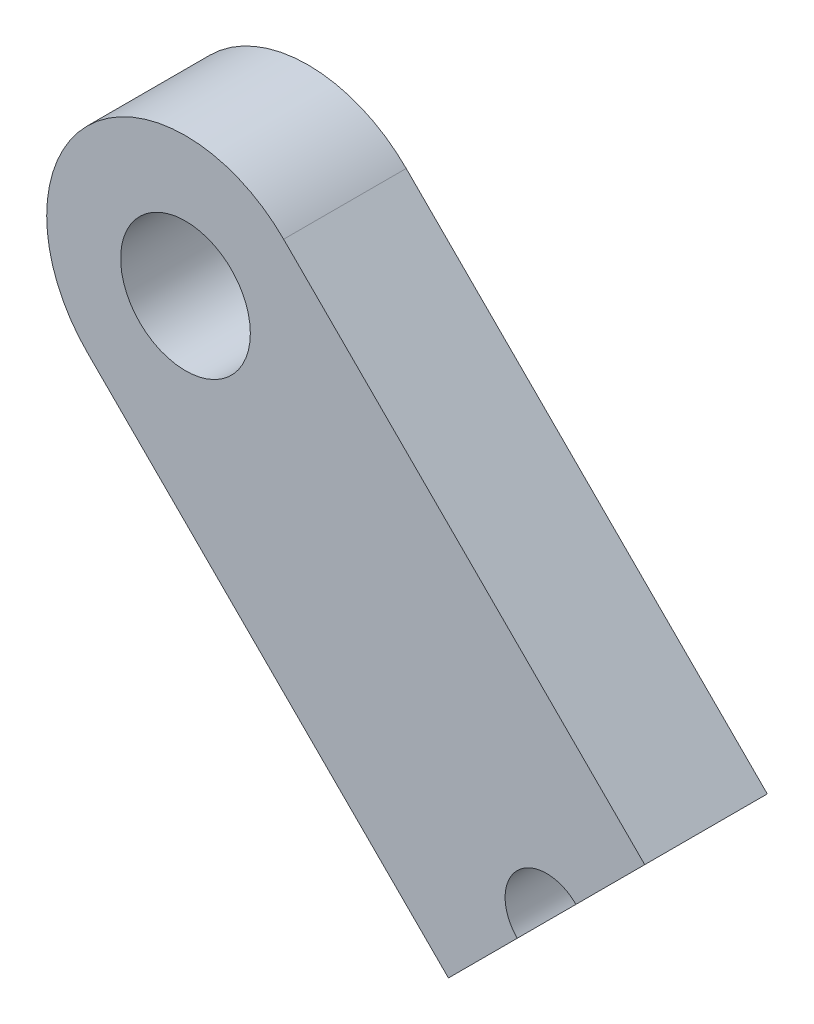
ISO-10303-21;
HEADER;
FILE_DESCRIPTION(('STEP AP214'),'2;1');
FILE_NAME('part.step','',(''),(''),'','','');
FILE_SCHEMA(('AUTOMOTIVE_DESIGN { 1 0 10303 214 1 1 1 1 }'));
ENDSEC;
DATA;
#1=APPLICATION_CONTEXT('core data for automotive mechanical design processes');
#2=APPLICATION_PROTOCOL_DEFINITION('international standard','automotive_design',2000,#1);
#3=PRODUCT_CONTEXT('',#1,'mechanical');
#4=PRODUCT('Part','Part','',(#3));
#5=PRODUCT_RELATED_PRODUCT_CATEGORY('part','',(#4));
#6=PRODUCT_DEFINITION_FORMATION('','',#4);
#7=PRODUCT_DEFINITION_CONTEXT('part definition',#1,'design');
#8=PRODUCT_DEFINITION('design','',#6,#7);
#9=PRODUCT_DEFINITION_SHAPE('','',#8);
#10=(LENGTH_UNIT() NAMED_UNIT(*) SI_UNIT(.MILLI.,.METRE.));
#11=(NAMED_UNIT(*) PLANE_ANGLE_UNIT() SI_UNIT($,.RADIAN.));
#12=(NAMED_UNIT(*) SI_UNIT($,.STERADIAN.) SOLID_ANGLE_UNIT());
#13=UNCERTAINTY_MEASURE_WITH_UNIT(LENGTH_MEASURE(1.E-05),#10,'distance_accuracy_value','');
#14=(GEOMETRIC_REPRESENTATION_CONTEXT(3) GLOBAL_UNCERTAINTY_ASSIGNED_CONTEXT((#13)) GLOBAL_UNIT_ASSIGNED_CONTEXT((#10,
#11,#12)) REPRESENTATION_CONTEXT('',''));
#15=CARTESIAN_POINT('',(0.,0.,0.));
#16=DIRECTION('',(0.,0.,1.));
#17=DIRECTION('',(1.,0.,0.));
#18=AXIS2_PLACEMENT_3D('',#15,#16,#17);
#19=CARTESIAN_POINT('',(3.92886205296779,41.7049072583143,-139.3165));
#20=DIRECTION('',(0.707106781186548,-0.707106781186547,0.));
#21=DIRECTION('',(0.707106781186547,0.707106781186548,0.));
#22=AXIS2_PLACEMENT_3D('',#19,#20,#21);
#23=PLANE('',#22);
#24=CARTESIAN_POINT('',(6.17392608323508,43.9499712885816,-139.3165));
#25=DIRECTION('',(-0.707106781186548,0.707106781186547,0.));
#26=DIRECTION('',(-0.707106781186547,-0.707106781186548,0.));
#27=AXIS2_PLACEMENT_3D('',#24,#25,#26);
#28=CIRCLE('',#27,3.175);
#29=CARTESIAN_POINT('',(3.9288620529678,41.7049072583143,-139.3165));
#30=VERTEX_POINT('',#29);
#31=EDGE_CURVE('E204',#30,#30,#28,.T.);
#32=ORIENTED_EDGE('',*,*,#31,.T.);
#33=EDGE_LOOP('',(#32));
#34=FACE_BOUND('',#33,.T.);
#35=DIRECTION('',(-0.707106781186546,-0.707106781186549,0.));
#36=VECTOR('',#35,1.);
#37=CARTESIAN_POINT('',(0.,37.7760452053466,-133.3165));
#38=LINE('',#37,#36);
#39=CARTESIAN_POINT('',(9.60887404954397,47.3849192548906,-133.3165));
#40=VERTEX_POINT('',#39);
#41=CARTESIAN_POINT('',(2.87368195874212,40.6497271640887,-133.3165));
#42=VERTEX_POINT('',#41);
#43=EDGE_CURVE('E106',#40,#42,#38,.T.);
#44=ORIENTED_EDGE('',*,*,#43,.T.);
#45=DIRECTION('',(0.,0.,-1.));
#46=VECTOR('',#45,1.);
#47=CARTESIAN_POINT('',(2.87368195874212,40.6497271640887,-133.3165));
#48=LINE('',#47,#46);
#49=CARTESIAN_POINT('',(2.87368195874212,40.6497271640887,-145.3165));
#50=VERTEX_POINT('',#49);
#51=EDGE_CURVE('E40',#42,#50,#48,.T.);
#52=ORIENTED_EDGE('',*,*,#51,.T.);
#53=DIRECTION('',(-0.707106781186546,-0.707106781186549,0.));
#54=VECTOR('',#53,1.);
#55=CARTESIAN_POINT('',(0.,37.7760452053466,-145.3165));
#56=LINE('',#55,#54);
#57=CARTESIAN_POINT('',(9.60887404954397,47.3849192548906,-145.3165));
#58=VERTEX_POINT('',#57);
#59=EDGE_CURVE('E104',#58,#50,#56,.T.);
#60=ORIENTED_EDGE('',*,*,#59,.F.);
#61=DIRECTION('',(0.,0.,-1.));
#62=VECTOR('',#61,1.);
#63=CARTESIAN_POINT('',(9.60887404954397,47.3849192548906,-133.3165));
#64=LINE('',#63,#62);
#65=EDGE_CURVE('E92',#40,#58,#64,.T.);
#66=ORIENTED_EDGE('',*,*,#65,.F.);
#67=EDGE_LOOP('',(#44,#52,#60,#66));
#68=FACE_BOUND('',#67,.T.);
#69=ADVANCED_FACE('F36',(#34,#68),#23,.T.);
#70=CARTESIAN_POINT('',(-7.29645809836864,57.4203554701853,-139.3165));
#71=DIRECTION('',(0.707106781186548,-0.707106781186547,0.));
#72=DIRECTION('',(0.707106781186547,0.707106781186548,0.));
#73=AXIS2_PLACEMENT_3D('',#70,#71,#72);
#74=PLANE('',#73);
#75=CARTESIAN_POINT('',(-7.29645809836866,57.4203554701853,-139.3165));
#76=DIRECTION('',(-0.707106781186548,0.707106781186547,0.));
#77=DIRECTION('',(-0.707106781186547,-0.707106781186548,0.));
#78=AXIS2_PLACEMENT_3D('',#75,#76,#77);
#79=CIRCLE('',#78,3.17499999999999);
#80=CARTESIAN_POINT('',(-9.54152212863594,55.175291439918,-139.3165));
#81=VERTEX_POINT('',#80);
#82=EDGE_CURVE('E208',#81,#81,#79,.T.);
#83=ORIENTED_EDGE('',*,*,#82,.F.);
#84=EDGE_LOOP('',(#83));
#85=FACE_BOUND('',#84,.T.);
#86=ADVANCED_FACE('F168',(#85),#74,.T.);
#87=CARTESIAN_POINT('',(6.17392608323508,43.9499712885816,-139.3165));
#88=DIRECTION('',(-0.707106781186548,0.707106781186547,0.));
#89=DIRECTION('',(-0.707106781186547,-0.707106781186548,0.));
#90=AXIS2_PLACEMENT_3D('',#87,#88,#89);
#91=CYLINDRICAL_SURFACE('',#90,3.17499999999999);
#92=ORIENTED_EDGE('',*,*,#82,.T.);
#93=EDGE_LOOP('',(#92));
#94=FACE_BOUND('',#93,.T.);
#95=ORIENTED_EDGE('',*,*,#31,.F.);
#96=EDGE_LOOP('',(#95));
#97=FACE_BOUND('',#96,.T.);
#98=ADVANCED_FACE('F175',(#94,#97),#91,.F.);
#99=CARTESIAN_POINT('',(-3.9288620529677,33.8471831523788,-139.3165));
#100=DIRECTION('',(0.70710678118655,-0.707106781186545,0.));
#101=DIRECTION('',(-0.707106781186545,-0.70710678118655,0.));
#102=AXIS2_PLACEMENT_3D('',#99,#100,#101);
#103=PLANE('',#102);
#104=CARTESIAN_POINT('',(-6.17392608323497,31.6021191221115,-139.3165));
#105=DIRECTION('',(0.70710678118655,-0.707106781186545,0.));
#106=DIRECTION('',(0.707106781186545,0.70710678118655,0.));
#107=AXIS2_PLACEMENT_3D('',#104,#105,#106);
#108=CIRCLE('',#107,3.175);
#109=CARTESIAN_POINT('',(-3.92886205296769,33.8471831523788,-139.3165));
#110=VERTEX_POINT('',#109);
#111=EDGE_CURVE('E205',#110,#110,#108,.T.);
#112=ORIENTED_EDGE('',*,*,#111,.F.);
#113=EDGE_LOOP('',(#112));
#114=FACE_BOUND('',#113,.T.);
#115=CARTESIAN_POINT('',(-2.87368195874213,34.9023632466045,-133.3165));
#116=VERTEX_POINT('',#115);
#117=CARTESIAN_POINT('',(-9.60887404954397,28.1671711558026,-133.3165));
#118=VERTEX_POINT('',#117);
#119=EDGE_CURVE('E136',#116,#118,#38,.T.);
#120=ORIENTED_EDGE('',*,*,#119,.T.);
#121=DIRECTION('',(0.,0.,-1.));
#122=VECTOR('',#121,1.);
#123=CARTESIAN_POINT('',(-9.60887404954397,28.1671711558026,-133.3165));
#124=LINE('',#123,#122);
#125=CARTESIAN_POINT('',(-9.60887404954397,28.1671711558026,-145.3165));
#126=VERTEX_POINT('',#125);
#127=EDGE_CURVE('E11',#118,#126,#124,.T.);
#128=ORIENTED_EDGE('',*,*,#127,.T.);
#129=CARTESIAN_POINT('',(-2.87368195874213,34.9023632466045,-145.3165));
#130=VERTEX_POINT('',#129);
#131=EDGE_CURVE('E53',#130,#126,#56,.T.);
#132=ORIENTED_EDGE('',*,*,#131,.F.);
#133=DIRECTION('',(0.,0.,-1.));
#134=VECTOR('',#133,1.);
#135=CARTESIAN_POINT('',(-2.87368195874213,34.9023632466045,-133.3165));
#136=LINE('',#135,#134);
#137=EDGE_CURVE('E45',#130,#116,#136,.F.);
#138=ORIENTED_EDGE('',*,*,#137,.T.);
#139=EDGE_LOOP('',(#120,#128,#132,#138));
#140=FACE_BOUND('',#139,.T.);
#141=ADVANCED_FACE('F145',(#114,#140),#103,.T.);
#142=CARTESIAN_POINT('',(-19.6443102648388,45.0725033037152,-139.3165));
#143=DIRECTION('',(0.70710678118655,-0.707106781186545,0.));
#144=DIRECTION('',(-0.707106781186545,-0.70710678118655,0.));
#145=AXIS2_PLACEMENT_3D('',#142,#143,#144);
#146=PLANE('',#145);
#147=CARTESIAN_POINT('',(-19.6443102648388,45.0725033037152,-139.3165));
#148=DIRECTION('',(0.70710678118655,-0.707106781186545,0.));
#149=DIRECTION('',(0.707106781186545,0.70710678118655,0.));
#150=AXIS2_PLACEMENT_3D('',#147,#148,#149);
#151=CIRCLE('',#150,3.17499999999999);
#152=CARTESIAN_POINT('',(-17.3992462345715,47.3175673339825,-139.3165));
#153=VERTEX_POINT('',#152);
#154=EDGE_CURVE('E203',#153,#153,#151,.T.);
#155=ORIENTED_EDGE('',*,*,#154,.T.);
#156=EDGE_LOOP('',(#155));
#157=FACE_BOUND('',#156,.T.);
#158=ADVANCED_FACE('F179',(#157),#146,.T.);
#159=CARTESIAN_POINT('',(-6.17392608323497,31.6021191221115,-139.3165));
#160=DIRECTION('',(-0.70710678118655,0.707106781186545,0.));
#161=DIRECTION('',(0.707106781186545,0.70710678118655,0.));
#162=AXIS2_PLACEMENT_3D('',#159,#160,#161);
#163=CYLINDRICAL_SURFACE('',#162,3.17499999999999);
#164=ORIENTED_EDGE('',*,*,#154,.F.);
#165=EDGE_LOOP('',(#164));
#166=FACE_BOUND('',#165,.T.);
#167=ORIENTED_EDGE('',*,*,#111,.T.);
#168=EDGE_LOOP('',(#167));
#169=FACE_BOUND('',#168,.T.);
#170=ADVANCED_FACE('F174',(#166,#169),#163,.F.);
#171=CARTESIAN_POINT('',(0.,37.7760452053466,-133.3165));
#172=DIRECTION('',(0.,0.,1.));
#173=DIRECTION('',(1.,0.,0.));
#174=AXIS2_PLACEMENT_3D('',#171,#172,#173);
#175=PLANE('',#174);
#176=ORIENTED_EDGE('',*,*,#43,.F.);
#177=DIRECTION('',(-0.707106781186549,0.707106781186546,0.));
#178=VECTOR('',#177,1.);
#179=CARTESIAN_POINT('',(9.60887404954397,47.3849192548906,-133.3165));
#180=LINE('',#179,#178);
#181=CARTESIAN_POINT('',(-25.7464650097835,82.7402583142179,-133.3165));
#182=VERTEX_POINT('',#181);
#183=EDGE_CURVE('E97',#40,#182,#180,.T.);
#184=ORIENTED_EDGE('',*,*,#183,.T.);
#185=CARTESIAN_POINT('',(-35.3553390593274,73.1313842646739,-133.3165));
#186=DIRECTION('',(0.,0.,1.));
#187=DIRECTION('',(1.,0.,0.));
#188=AXIS2_PLACEMENT_3D('',#185,#186,#187);
#189=CIRCLE('',#188,13.589);
#190=CARTESIAN_POINT('',(-44.9642131088714,63.5225102151299,-133.3165));
#191=VERTEX_POINT('',#190);
#192=EDGE_CURVE('E128',#182,#191,#189,.T.);
#193=ORIENTED_EDGE('',*,*,#192,.T.);
#194=DIRECTION('',(0.707106781186549,-0.707106781186546,0.));
#195=VECTOR('',#194,1.);
#196=CARTESIAN_POINT('',(-9.60887404954397,28.1671711558026,-133.3165));
#197=LINE('',#196,#195);
#198=EDGE_CURVE('E130',#191,#118,#197,.T.);
#199=ORIENTED_EDGE('',*,*,#198,.T.);
#200=ORIENTED_EDGE('',*,*,#119,.F.);
#201=CARTESIAN_POINT('',(0.,37.7760452053466,-133.3165));
#202=DIRECTION('',(0.,0.,1.));
#203=DIRECTION('',(1.,0.,0.));
#204=AXIS2_PLACEMENT_3D('',#201,#202,#203);
#205=CIRCLE('',#204,4.064);
#206=EDGE_CURVE('E124',#42,#116,#205,.T.);
#207=ORIENTED_EDGE('',*,*,#206,.F.);
#208=EDGE_LOOP('',(#176,#184,#193,#199,#200,#207));
#209=FACE_BOUND('',#208,.T.);
#210=CARTESIAN_POINT('',(-35.3553390593274,73.1313842646739,-133.3165));
#211=DIRECTION('',(0.,0.,1.));
#212=DIRECTION('',(1.,0.,0.));
#213=AXIS2_PLACEMENT_3D('',#210,#211,#212);
#214=CIRCLE('',#213,6.35);
#215=CARTESIAN_POINT('',(-29.0053390593274,73.1313842646739,-133.3165));
#216=VERTEX_POINT('',#215);
#217=EDGE_CURVE('E121',#216,#216,#214,.T.);
#218=ORIENTED_EDGE('',*,*,#217,.F.);
#219=EDGE_LOOP('',(#218));
#220=FACE_BOUND('',#219,.T.);
#221=ADVANCED_FACE('F141',(#209,#220),#175,.T.);
#222=CARTESIAN_POINT('',(9.60887404954397,47.3849192548906,-133.3165));
#223=DIRECTION('',(-0.707106781186546,-0.707106781186549,0.));
#224=DIRECTION('',(0.707106781186549,-0.707106781186546,0.));
#225=AXIS2_PLACEMENT_3D('',#222,#223,#224);
#226=PLANE('',#225);
#227=ORIENTED_EDGE('',*,*,#65,.T.);
#228=DIRECTION('',(-0.707106781186549,0.707106781186546,0.));
#229=VECTOR('',#228,1.);
#230=CARTESIAN_POINT('',(9.60887404954397,47.3849192548906,-145.3165));
#231=LINE('',#230,#229);
#232=CARTESIAN_POINT('',(-25.7464650097835,82.7402583142179,-145.3165));
#233=VERTEX_POINT('',#232);
#234=EDGE_CURVE('E96',#58,#233,#231,.T.);
#235=ORIENTED_EDGE('',*,*,#234,.T.);
#236=DIRECTION('',(0.,0.,-1.));
#237=VECTOR('',#236,1.);
#238=CARTESIAN_POINT('',(-25.7464650097835,82.7402583142179,-133.3165));
#239=LINE('',#238,#237);
#240=EDGE_CURVE('E101',#182,#233,#239,.T.);
#241=ORIENTED_EDGE('',*,*,#240,.F.);
#242=ORIENTED_EDGE('',*,*,#183,.F.);
#243=EDGE_LOOP('',(#227,#235,#241,#242));
#244=FACE_BOUND('',#243,.T.);
#245=ADVANCED_FACE('F38',(#244),#226,.F.);
#246=CARTESIAN_POINT('',(-35.3553390593274,73.1313842646739,-133.3165));
#247=DIRECTION('',(0.,0.,-1.));
#248=DIRECTION('',(-1.,0.,0.));
#249=AXIS2_PLACEMENT_3D('',#246,#247,#248);
#250=CYLINDRICAL_SURFACE('',#249,13.589);
#251=ORIENTED_EDGE('',*,*,#240,.T.);
#252=CARTESIAN_POINT('',(-35.3553390593274,73.1313842646739,-145.3165));
#253=DIRECTION('',(0.,0.,1.));
#254=DIRECTION('',(1.,0.,0.));
#255=AXIS2_PLACEMENT_3D('',#252,#253,#254);
#256=CIRCLE('',#255,13.589);
#257=CARTESIAN_POINT('',(-44.9642131088714,63.5225102151299,-145.3165));
#258=VERTEX_POINT('',#257);
#259=EDGE_CURVE('E111',#233,#258,#256,.T.);
#260=ORIENTED_EDGE('',*,*,#259,.T.);
#261=DIRECTION('',(0.,0.,-1.));
#262=VECTOR('',#261,1.);
#263=CARTESIAN_POINT('',(-44.9642131088714,63.5225102151299,-133.3165));
#264=LINE('',#263,#262);
#265=EDGE_CURVE('E132',#191,#258,#264,.T.);
#266=ORIENTED_EDGE('',*,*,#265,.F.);
#267=ORIENTED_EDGE('',*,*,#192,.F.);
#268=EDGE_LOOP('',(#251,#260,#266,#267));
#269=FACE_BOUND('',#268,.T.);
#270=ADVANCED_FACE('F150',(#269),#250,.T.);
#271=CARTESIAN_POINT('',(-9.60887404954397,28.1671711558026,-133.3165));
#272=DIRECTION('',(0.707106781186546,0.707106781186549,0.));
#273=DIRECTION('',(-0.707106781186549,0.707106781186546,0.));
#274=AXIS2_PLACEMENT_3D('',#271,#272,#273);
#275=PLANE('',#274);
#276=ORIENTED_EDGE('',*,*,#265,.T.);
#277=DIRECTION('',(0.707106781186549,-0.707106781186546,0.));
#278=VECTOR('',#277,1.);
#279=CARTESIAN_POINT('',(-9.60887404954397,28.1671711558026,-145.3165));
#280=LINE('',#279,#278);
#281=EDGE_CURVE('E114',#258,#126,#280,.T.);
#282=ORIENTED_EDGE('',*,*,#281,.T.);
#283=ORIENTED_EDGE('',*,*,#127,.F.);
#284=ORIENTED_EDGE('',*,*,#198,.F.);
#285=EDGE_LOOP('',(#276,#282,#283,#284));
#286=FACE_BOUND('',#285,.T.);
#287=ADVANCED_FACE('F146',(#286),#275,.F.);
#288=CARTESIAN_POINT('',(0.,37.7760452053466,-133.3165));
#289=DIRECTION('',(0.,0.,-1.));
#290=DIRECTION('',(-1.,0.,0.));
#291=AXIS2_PLACEMENT_3D('',#288,#289,#290);
#292=CYLINDRICAL_SURFACE('',#291,4.064);
#293=ORIENTED_EDGE('',*,*,#51,.F.);
#294=ORIENTED_EDGE('',*,*,#206,.T.);
#295=ORIENTED_EDGE('',*,*,#137,.F.);
#296=CARTESIAN_POINT('',(0.,37.7760452053466,-145.3165));
#297=DIRECTION('',(0.,0.,1.));
#298=DIRECTION('',(1.,0.,0.));
#299=AXIS2_PLACEMENT_3D('',#296,#297,#298);
#300=CIRCLE('',#299,4.064);
#301=EDGE_CURVE('E112',#50,#130,#300,.T.);
#302=ORIENTED_EDGE('',*,*,#301,.F.);
#303=EDGE_LOOP('',(#293,#294,#295,#302));
#304=FACE_BOUND('',#303,.T.);
#305=ADVANCED_FACE('F144',(#304),#292,.F.);
#306=CARTESIAN_POINT('',(-35.3553390593274,73.1313842646739,-133.3165));
#307=DIRECTION('',(0.,0.,-1.));
#308=DIRECTION('',(-1.,0.,0.));
#309=AXIS2_PLACEMENT_3D('',#306,#307,#308);
#310=CYLINDRICAL_SURFACE('',#309,6.35);
#311=ORIENTED_EDGE('',*,*,#217,.T.);
#312=EDGE_LOOP('',(#311));
#313=FACE_BOUND('',#312,.T.);
#314=CARTESIAN_POINT('',(-35.3553390593274,73.1313842646739,-145.3165));
#315=DIRECTION('',(0.,0.,1.));
#316=DIRECTION('',(1.,0.,0.));
#317=AXIS2_PLACEMENT_3D('',#314,#315,#316);
#318=CIRCLE('',#317,6.35);
#319=CARTESIAN_POINT('',(-29.0053390593274,73.1313842646739,-145.3165));
#320=VERTEX_POINT('',#319);
#321=EDGE_CURVE('E116',#320,#320,#318,.T.);
#322=ORIENTED_EDGE('',*,*,#321,.F.);
#323=EDGE_LOOP('',(#322));
#324=FACE_BOUND('',#323,.T.);
#325=ADVANCED_FACE('F158',(#313,#324),#310,.F.);
#326=CARTESIAN_POINT('',(0.,37.7760452053466,-145.3165));
#327=DIRECTION('',(0.,0.,1.));
#328=DIRECTION('',(1.,0.,0.));
#329=AXIS2_PLACEMENT_3D('',#326,#327,#328);
#330=PLANE('',#329);
#331=ORIENTED_EDGE('',*,*,#321,.T.);
#332=EDGE_LOOP('',(#331));
#333=FACE_BOUND('',#332,.T.);
#334=ORIENTED_EDGE('',*,*,#234,.F.);
#335=ORIENTED_EDGE('',*,*,#59,.T.);
#336=ORIENTED_EDGE('',*,*,#301,.T.);
#337=ORIENTED_EDGE('',*,*,#131,.T.);
#338=ORIENTED_EDGE('',*,*,#281,.F.);
#339=ORIENTED_EDGE('',*,*,#259,.F.);
#340=EDGE_LOOP('',(#334,#335,#336,#337,#338,#339));
#341=FACE_BOUND('',#340,.T.);
#342=ADVANCED_FACE('F109',(#333,#341),#330,.F.);
#343=CLOSED_SHELL('',(#69,#86,#98,#141,#158,#170,#221,#245,#270,#287,#305,#325,#342));
#344=MANIFOLD_SOLID_BREP('B2',#343);
#345=ADVANCED_BREP_SHAPE_REPRESENTATION('',(#18,#344),#14);
#346=SHAPE_DEFINITION_REPRESENTATION(#9,#345);
ENDSEC;
END-ISO-10303-21;
